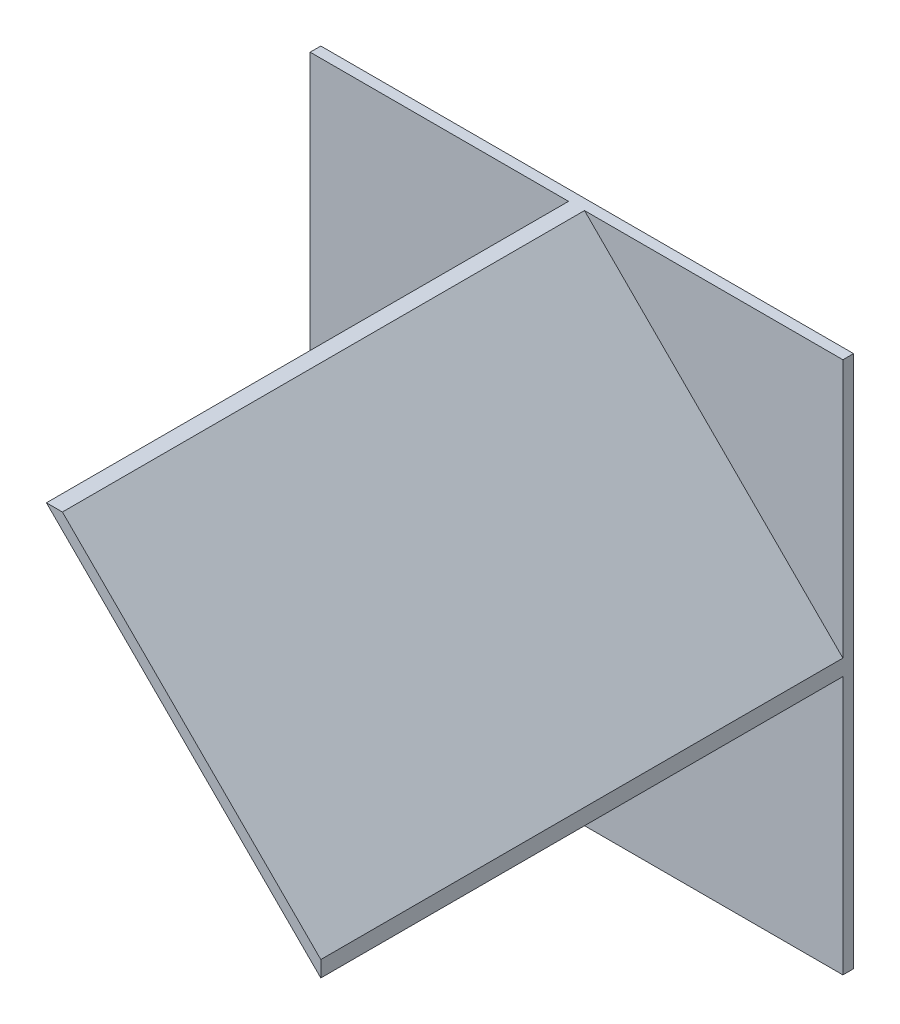
ISO-10303-21;
HEADER;
FILE_DESCRIPTION(('STEP AP214'),'2;1');
FILE_NAME('part.step','',(''),(''),'','','');
FILE_SCHEMA(('AUTOMOTIVE_DESIGN { 1 0 10303 214 1 1 1 1 }'));
ENDSEC;
DATA;
#1=APPLICATION_CONTEXT('core data for automotive mechanical design processes');
#2=APPLICATION_PROTOCOL_DEFINITION('international standard','automotive_design',2000,#1);
#3=PRODUCT_CONTEXT('',#1,'mechanical');
#4=PRODUCT('Part','Part','',(#3));
#5=PRODUCT_RELATED_PRODUCT_CATEGORY('part','',(#4));
#6=PRODUCT_DEFINITION_FORMATION('','',#4);
#7=PRODUCT_DEFINITION_CONTEXT('part definition',#1,'design');
#8=PRODUCT_DEFINITION('design','',#6,#7);
#9=PRODUCT_DEFINITION_SHAPE('','',#8);
#10=(LENGTH_UNIT() NAMED_UNIT(*) SI_UNIT(.MILLI.,.METRE.));
#11=(NAMED_UNIT(*) PLANE_ANGLE_UNIT() SI_UNIT($,.RADIAN.));
#12=(NAMED_UNIT(*) SI_UNIT($,.STERADIAN.) SOLID_ANGLE_UNIT());
#13=UNCERTAINTY_MEASURE_WITH_UNIT(LENGTH_MEASURE(1.E-05),#10,'distance_accuracy_value','');
#14=(GEOMETRIC_REPRESENTATION_CONTEXT(3) GLOBAL_UNCERTAINTY_ASSIGNED_CONTEXT((#13)) GLOBAL_UNIT_ASSIGNED_CONTEXT((#10,
#11,#12)) REPRESENTATION_CONTEXT('',''));
#15=CARTESIAN_POINT('',(0.,0.,0.));
#16=DIRECTION('',(0.,0.,1.));
#17=DIRECTION('',(1.,0.,0.));
#18=AXIS2_PLACEMENT_3D('',#15,#16,#17);
#19=CARTESIAN_POINT('',(0.,0.,4.));
#20=DIRECTION('',(0.,0.,1.));
#21=DIRECTION('',(1.,0.,0.));
#22=AXIS2_PLACEMENT_3D('',#19,#20,#21);
#23=PLANE('',#22);
#24=DIRECTION('',(-1.,0.,0.));
#25=VECTOR('',#24,1.);
#26=CARTESIAN_POINT('',(0.,100.,4.));
#27=LINE('',#26,#25);
#28=CARTESIAN_POINT('',(100.,100.,4.));
#29=VERTEX_POINT('',#28);
#30=CARTESIAN_POINT('',(3.,100.,4.));
#31=VERTEX_POINT('',#30);
#32=EDGE_CURVE('E63',#29,#31,#27,.T.);
#33=ORIENTED_EDGE('',*,*,#32,.T.);
#34=DIRECTION('',(0.707106781186547,-0.707106781186548,0.));
#35=VECTOR('',#34,1.);
#36=CARTESIAN_POINT('',(3.,100.,4.));
#37=LINE('',#36,#35);
#38=CARTESIAN_POINT('',(100.,2.99999999999992,4.));
#39=VERTEX_POINT('',#38);
#40=EDGE_CURVE('E140',#31,#39,#37,.T.);
#41=ORIENTED_EDGE('',*,*,#40,.T.);
#42=DIRECTION('',(0.,-1.,0.));
#43=VECTOR('',#42,1.);
#44=CARTESIAN_POINT('',(100.,0.,4.));
#45=LINE('',#44,#43);
#46=EDGE_CURVE('E123',#29,#39,#45,.T.);
#47=ORIENTED_EDGE('',*,*,#46,.F.);
#48=EDGE_LOOP('',(#33,#41,#47));
#49=FACE_BOUND('',#48,.T.);
#50=ADVANCED_FACE('F39',(#49),#23,.T.);
#51=CARTESIAN_POINT('',(0.,-100.,4.));
#52=DIRECTION('',(0.,-1.,0.));
#53=DIRECTION('',(0.,0.,-1.));
#54=AXIS2_PLACEMENT_3D('',#51,#52,#53);
#55=PLANE('',#54);
#56=DIRECTION('',(-1.,0.,0.));
#57=VECTOR('',#56,1.);
#58=CARTESIAN_POINT('',(0.,-100.,0.));
#59=LINE('',#58,#57);
#60=CARTESIAN_POINT('',(100.,-100.,0.));
#61=VERTEX_POINT('',#60);
#62=CARTESIAN_POINT('',(-100.,-100.,0.));
#63=VERTEX_POINT('',#62);
#64=EDGE_CURVE('E127',#61,#63,#59,.T.);
#65=ORIENTED_EDGE('',*,*,#64,.F.);
#66=DIRECTION('',(0.,0.,-1.));
#67=VECTOR('',#66,1.);
#68=CARTESIAN_POINT('',(100.,-100.,4.));
#69=LINE('',#68,#67);
#70=CARTESIAN_POINT('',(100.,-100.,4.));
#71=VERTEX_POINT('',#70);
#72=EDGE_CURVE('E11',#71,#61,#69,.T.);
#73=ORIENTED_EDGE('',*,*,#72,.F.);
#74=DIRECTION('',(-1.,0.,0.));
#75=VECTOR('',#74,1.);
#76=CARTESIAN_POINT('',(0.,-100.,4.));
#77=LINE('',#76,#75);
#78=CARTESIAN_POINT('',(-100.,-100.,4.));
#79=VERTEX_POINT('',#78);
#80=EDGE_CURVE('E153',#71,#79,#77,.T.);
#81=ORIENTED_EDGE('',*,*,#80,.T.);
#82=DIRECTION('',(0.,0.,-1.));
#83=VECTOR('',#82,1.);
#84=CARTESIAN_POINT('',(-100.,-100.,4.));
#85=LINE('',#84,#83);
#86=EDGE_CURVE('E167',#79,#63,#85,.T.);
#87=ORIENTED_EDGE('',*,*,#86,.T.);
#88=EDGE_LOOP('',(#65,#73,#81,#87));
#89=FACE_BOUND('',#88,.T.);
#90=ADVANCED_FACE('F41',(#89),#55,.T.);
#91=CARTESIAN_POINT('',(100.,0.,4.));
#92=DIRECTION('',(1.,0.,0.));
#93=DIRECTION('',(0.,0.,-1.));
#94=AXIS2_PLACEMENT_3D('',#91,#92,#93);
#95=PLANE('',#94);
#96=DIRECTION('',(0.,-1.,0.));
#97=VECTOR('',#96,1.);
#98=CARTESIAN_POINT('',(100.,0.,0.));
#99=LINE('',#98,#97);
#100=CARTESIAN_POINT('',(100.,100.,0.));
#101=VERTEX_POINT('',#100);
#102=EDGE_CURVE('E171',#101,#61,#99,.T.);
#103=ORIENTED_EDGE('',*,*,#102,.F.);
#104=DIRECTION('',(0.,0.,-1.));
#105=VECTOR('',#104,1.);
#106=CARTESIAN_POINT('',(100.,100.,4.));
#107=LINE('',#106,#105);
#108=EDGE_CURVE('E48',#29,#101,#107,.T.);
#109=ORIENTED_EDGE('',*,*,#108,.F.);
#110=ORIENTED_EDGE('',*,*,#46,.T.);
#111=DIRECTION('',(0.,0.,-1.));
#112=VECTOR('',#111,1.);
#113=CARTESIAN_POINT('',(100.,2.99999999999991,200.));
#114=LINE('',#113,#112);
#115=CARTESIAN_POINT('',(100.,2.99999999999991,200.));
#116=VERTEX_POINT('',#115);
#117=EDGE_CURVE('E120',#116,#39,#114,.T.);
#118=ORIENTED_EDGE('',*,*,#117,.F.);
#119=DIRECTION('',(0.,1.,0.));
#120=VECTOR('',#119,1.);
#121=CARTESIAN_POINT('',(100.,0.,200.));
#122=LINE('',#121,#120);
#123=CARTESIAN_POINT('',(100.,-3.00000000000009,200.));
#124=VERTEX_POINT('',#123);
#125=EDGE_CURVE('E105',#124,#116,#122,.T.);
#126=ORIENTED_EDGE('',*,*,#125,.F.);
#127=DIRECTION('',(0.,0.,-1.));
#128=VECTOR('',#127,1.);
#129=CARTESIAN_POINT('',(100.,-3.00000000000009,200.));
#130=LINE('',#129,#128);
#131=CARTESIAN_POINT('',(100.,-3.00000000000009,4.));
#132=VERTEX_POINT('',#131);
#133=EDGE_CURVE('E139',#124,#132,#130,.T.);
#134=ORIENTED_EDGE('',*,*,#133,.T.);
#135=EDGE_CURVE('E157',#132,#71,#45,.T.);
#136=ORIENTED_EDGE('',*,*,#135,.T.);
#137=ORIENTED_EDGE('',*,*,#72,.T.);
#138=EDGE_LOOP('',(#103,#109,#110,#118,#126,#134,#136,#137));
#139=FACE_BOUND('',#138,.T.);
#140=ADVANCED_FACE('F122',(#139),#95,.T.);
#141=CARTESIAN_POINT('',(0.,100.,4.));
#142=DIRECTION('',(0.,-1.,0.));
#143=DIRECTION('',(0.,0.,-1.));
#144=AXIS2_PLACEMENT_3D('',#141,#142,#143);
#145=PLANE('',#144);
#146=DIRECTION('',(-1.,0.,0.));
#147=VECTOR('',#146,1.);
#148=CARTESIAN_POINT('',(0.,100.,0.));
#149=LINE('',#148,#147);
#150=CARTESIAN_POINT('',(-100.,100.,0.));
#151=VERTEX_POINT('',#150);
#152=EDGE_CURVE('E175',#101,#151,#149,.T.);
#153=ORIENTED_EDGE('',*,*,#152,.T.);
#154=DIRECTION('',(0.,0.,-1.));
#155=VECTOR('',#154,1.);
#156=CARTESIAN_POINT('',(-100.,100.,4.));
#157=LINE('',#156,#155);
#158=CARTESIAN_POINT('',(-100.,100.,4.));
#159=VERTEX_POINT('',#158);
#160=EDGE_CURVE('E183',#159,#151,#157,.T.);
#161=ORIENTED_EDGE('',*,*,#160,.F.);
#162=CARTESIAN_POINT('',(-2.99999999999999,100.,4.));
#163=VERTEX_POINT('',#162);
#164=EDGE_CURVE('E161',#163,#159,#27,.T.);
#165=ORIENTED_EDGE('',*,*,#164,.F.);
#166=DIRECTION('',(0.,0.,-1.));
#167=VECTOR('',#166,1.);
#168=CARTESIAN_POINT('',(-3.,100.,200.));
#169=LINE('',#168,#167);
#170=CARTESIAN_POINT('',(-3.,100.,200.));
#171=VERTEX_POINT('',#170);
#172=EDGE_CURVE('E147',#171,#163,#169,.T.);
#173=ORIENTED_EDGE('',*,*,#172,.F.);
#174=DIRECTION('',(1.,0.,0.));
#175=VECTOR('',#174,1.);
#176=CARTESIAN_POINT('',(0.,100.,200.));
#177=LINE('',#176,#175);
#178=CARTESIAN_POINT('',(3.,100.,200.));
#179=VERTEX_POINT('',#178);
#180=EDGE_CURVE('E132',#171,#179,#177,.T.);
#181=ORIENTED_EDGE('',*,*,#180,.T.);
#182=DIRECTION('',(0.,0.,-1.));
#183=VECTOR('',#182,1.);
#184=CARTESIAN_POINT('',(3.,100.,200.));
#185=LINE('',#184,#183);
#186=EDGE_CURVE('E128',#179,#31,#185,.T.);
#187=ORIENTED_EDGE('',*,*,#186,.T.);
#188=ORIENTED_EDGE('',*,*,#32,.F.);
#189=ORIENTED_EDGE('',*,*,#108,.T.);
#190=EDGE_LOOP('',(#153,#161,#165,#173,#181,#187,#188,#189));
#191=FACE_BOUND('',#190,.T.);
#192=ADVANCED_FACE('F189',(#191),#145,.F.);
#193=CARTESIAN_POINT('',(-100.,0.,4.));
#194=DIRECTION('',(1.,0.,0.));
#195=DIRECTION('',(0.,0.,-1.));
#196=AXIS2_PLACEMENT_3D('',#193,#194,#195);
#197=PLANE('',#196);
#198=DIRECTION('',(0.,-1.,0.));
#199=VECTOR('',#198,1.);
#200=CARTESIAN_POINT('',(-100.,0.,0.));
#201=LINE('',#200,#199);
#202=EDGE_CURVE('E158',#151,#63,#201,.T.);
#203=ORIENTED_EDGE('',*,*,#202,.T.);
#204=ORIENTED_EDGE('',*,*,#86,.F.);
#205=DIRECTION('',(0.,-1.,0.));
#206=VECTOR('',#205,1.);
#207=CARTESIAN_POINT('',(-100.,0.,4.));
#208=LINE('',#207,#206);
#209=EDGE_CURVE('E164',#159,#79,#208,.T.);
#210=ORIENTED_EDGE('',*,*,#209,.F.);
#211=ORIENTED_EDGE('',*,*,#160,.T.);
#212=EDGE_LOOP('',(#203,#204,#210,#211));
#213=FACE_BOUND('',#212,.T.);
#214=ADVANCED_FACE('F201',(#213),#197,.F.);
#215=DIRECTION('',(0.707106781186547,-0.707106781186548,0.));
#216=VECTOR('',#215,1.);
#217=CARTESIAN_POINT('',(-3.,100.,4.));
#218=LINE('',#217,#216);
#219=EDGE_CURVE('E55',#163,#132,#218,.T.);
#220=ORIENTED_EDGE('',*,*,#219,.F.);
#221=ORIENTED_EDGE('',*,*,#164,.T.);
#222=ORIENTED_EDGE('',*,*,#209,.T.);
#223=ORIENTED_EDGE('',*,*,#80,.F.);
#224=ORIENTED_EDGE('',*,*,#135,.F.);
#225=EDGE_LOOP('',(#220,#221,#222,#223,#224));
#226=FACE_BOUND('',#225,.T.);
#227=ADVANCED_FACE('F216',(#226),#23,.T.);
#228=CARTESIAN_POINT('',(0.,0.,0.));
#229=DIRECTION('',(0.,0.,1.));
#230=DIRECTION('',(1.,0.,0.));
#231=AXIS2_PLACEMENT_3D('',#228,#229,#230);
#232=PLANE('',#231);
#233=ORIENTED_EDGE('',*,*,#64,.T.);
#234=ORIENTED_EDGE('',*,*,#202,.F.);
#235=ORIENTED_EDGE('',*,*,#152,.F.);
#236=ORIENTED_EDGE('',*,*,#102,.T.);
#237=EDGE_LOOP('',(#233,#234,#235,#236));
#238=FACE_BOUND('',#237,.T.);
#239=ADVANCED_FACE('F193',(#238),#232,.F.);
#240=CARTESIAN_POINT('',(3.,100.,200.));
#241=DIRECTION('',(0.707106781186548,0.707106781186547,0.));
#242=DIRECTION('',(-0.707106781186547,0.707106781186548,0.));
#243=AXIS2_PLACEMENT_3D('',#240,#241,#242);
#244=PLANE('',#243);
#245=ORIENTED_EDGE('',*,*,#40,.F.);
#246=ORIENTED_EDGE('',*,*,#186,.F.);
#247=DIRECTION('',(0.707106781186547,-0.707106781186548,0.));
#248=VECTOR('',#247,1.);
#249=CARTESIAN_POINT('',(3.,100.,200.));
#250=LINE('',#249,#248);
#251=EDGE_CURVE('E109',#179,#116,#250,.T.);
#252=ORIENTED_EDGE('',*,*,#251,.T.);
#253=ORIENTED_EDGE('',*,*,#117,.T.);
#254=EDGE_LOOP('',(#245,#246,#252,#253));
#255=FACE_BOUND('',#254,.T.);
#256=ADVANCED_FACE('F130',(#255),#244,.T.);
#257=CARTESIAN_POINT('',(-3.,100.,200.));
#258=DIRECTION('',(0.707106781186548,0.707106781186547,0.));
#259=DIRECTION('',(-0.707106781186547,0.707106781186548,0.));
#260=AXIS2_PLACEMENT_3D('',#257,#258,#259);
#261=PLANE('',#260);
#262=ORIENTED_EDGE('',*,*,#219,.T.);
#263=ORIENTED_EDGE('',*,*,#133,.F.);
#264=DIRECTION('',(0.707106781186547,-0.707106781186548,0.));
#265=VECTOR('',#264,1.);
#266=CARTESIAN_POINT('',(-3.,100.,200.));
#267=LINE('',#266,#265);
#268=EDGE_CURVE('E112',#171,#124,#267,.T.);
#269=ORIENTED_EDGE('',*,*,#268,.F.);
#270=ORIENTED_EDGE('',*,*,#172,.T.);
#271=EDGE_LOOP('',(#262,#263,#269,#270));
#272=FACE_BOUND('',#271,.T.);
#273=ADVANCED_FACE('F205',(#272),#261,.F.);
#274=CARTESIAN_POINT('',(0.,0.,200.));
#275=DIRECTION('',(0.,0.,-1.));
#276=DIRECTION('',(-1.,0.,0.));
#277=AXIS2_PLACEMENT_3D('',#274,#275,#276);
#278=PLANE('',#277);
#279=ORIENTED_EDGE('',*,*,#125,.T.);
#280=ORIENTED_EDGE('',*,*,#251,.F.);
#281=ORIENTED_EDGE('',*,*,#180,.F.);
#282=ORIENTED_EDGE('',*,*,#268,.T.);
#283=EDGE_LOOP('',(#279,#280,#281,#282));
#284=FACE_BOUND('',#283,.T.);
#285=ADVANCED_FACE('F107',(#284),#278,.F.);
#286=CLOSED_SHELL('',(#50,#90,#140,#192,#214,#227,#239,#256,#273,#285));
#287=MANIFOLD_SOLID_BREP('B2',#286);
#288=ADVANCED_BREP_SHAPE_REPRESENTATION('',(#18,#287),#14);
#289=SHAPE_DEFINITION_REPRESENTATION(#9,#288);
ENDSEC;
END-ISO-10303-21;
